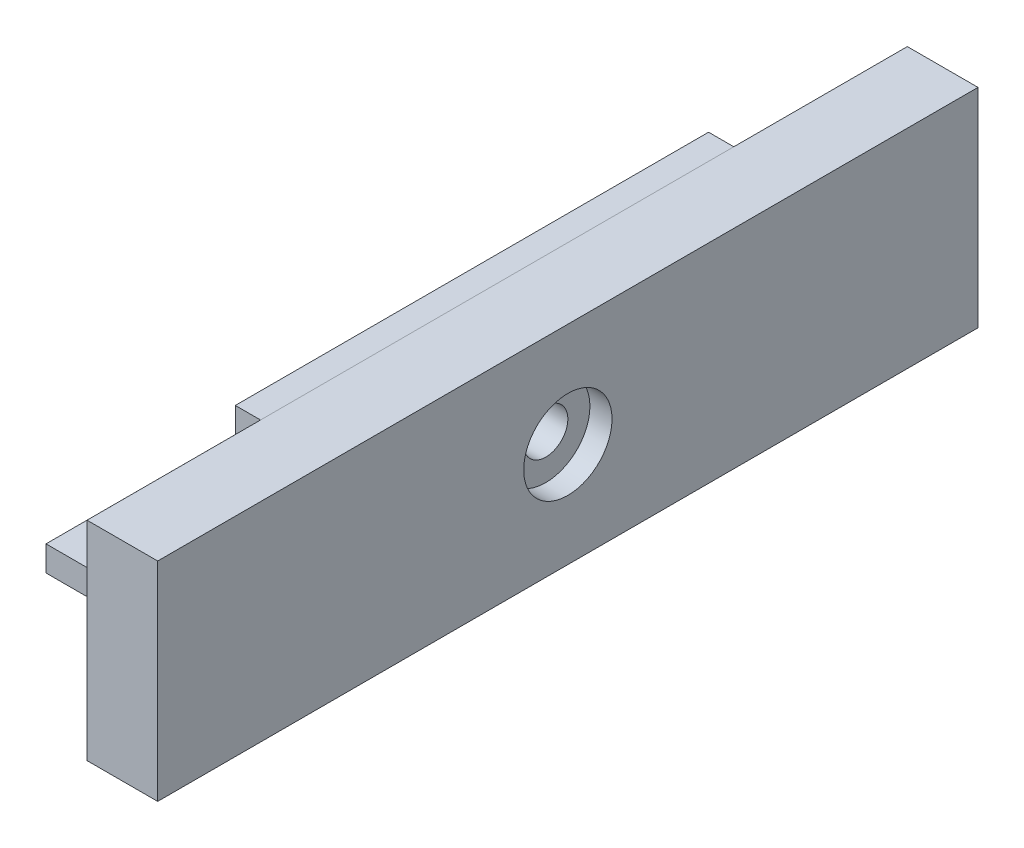
ISO-10303-21;
HEADER;
FILE_DESCRIPTION(('STEP AP214'),'2;1');
FILE_NAME('part.step','',(''),(''),'','','');
FILE_SCHEMA(('AUTOMOTIVE_DESIGN { 1 0 10303 214 1 1 1 1 }'));
ENDSEC;
DATA;
#1=APPLICATION_CONTEXT('core data for automotive mechanical design processes');
#2=APPLICATION_PROTOCOL_DEFINITION('international standard','automotive_design',2000,#1);
#3=PRODUCT_CONTEXT('',#1,'mechanical');
#4=PRODUCT('Part','Part','',(#3));
#5=PRODUCT_RELATED_PRODUCT_CATEGORY('part','',(#4));
#6=PRODUCT_DEFINITION_FORMATION('','',#4);
#7=PRODUCT_DEFINITION_CONTEXT('part definition',#1,'design');
#8=PRODUCT_DEFINITION('design','',#6,#7);
#9=PRODUCT_DEFINITION_SHAPE('','',#8);
#10=(LENGTH_UNIT() NAMED_UNIT(*) SI_UNIT(.MILLI.,.METRE.));
#11=(NAMED_UNIT(*) PLANE_ANGLE_UNIT() SI_UNIT($,.RADIAN.));
#12=(NAMED_UNIT(*) SI_UNIT($,.STERADIAN.) SOLID_ANGLE_UNIT());
#13=UNCERTAINTY_MEASURE_WITH_UNIT(LENGTH_MEASURE(1.E-05),#10,'distance_accuracy_value','');
#14=(GEOMETRIC_REPRESENTATION_CONTEXT(3) GLOBAL_UNCERTAINTY_ASSIGNED_CONTEXT((#13)) GLOBAL_UNIT_ASSIGNED_CONTEXT((#10,
#11,#12)) REPRESENTATION_CONTEXT('',''));
#15=CARTESIAN_POINT('',(0.,0.,0.));
#16=DIRECTION('',(0.,0.,1.));
#17=DIRECTION('',(1.,0.,0.));
#18=AXIS2_PLACEMENT_3D('',#15,#16,#17);
#19=CARTESIAN_POINT('',(-4.,0.,-37.5));
#20=DIRECTION('',(0.,0.,-1.));
#21=DIRECTION('',(-1.,0.,0.));
#22=AXIS2_PLACEMENT_3D('',#19,#20,#21);
#23=PLANE('',#22);
#24=DIRECTION('',(0.,1.,0.));
#25=VECTOR('',#24,1.);
#26=CARTESIAN_POINT('',(0.,0.,-37.5));
#27=LINE('',#26,#25);
#28=CARTESIAN_POINT('',(0.,-21.5,-37.5));
#29=VERTEX_POINT('',#28);
#30=CARTESIAN_POINT('',(0.,16.5,-37.5));
#31=VERTEX_POINT('',#30);
#32=EDGE_CURVE('E95',#29,#31,#27,.T.);
#33=ORIENTED_EDGE('',*,*,#32,.F.);
#34=DIRECTION('',(1.,0.,0.));
#35=VECTOR('',#34,1.);
#36=CARTESIAN_POINT('',(-4.,-21.5,-37.5));
#37=LINE('',#36,#35);
#38=CARTESIAN_POINT('',(-34.,-21.5,-37.5));
#39=VERTEX_POINT('',#38);
#40=EDGE_CURVE('E12',#39,#29,#37,.T.);
#41=ORIENTED_EDGE('',*,*,#40,.F.);
#42=DIRECTION('',(0.,-1.,0.));
#43=VECTOR('',#42,1.);
#44=CARTESIAN_POINT('',(-34.,-21.5,-37.5));
#45=LINE('',#44,#43);
#46=CARTESIAN_POINT('',(-34.,-17.4979666653314,-37.5));
#47=VERTEX_POINT('',#46);
#48=EDGE_CURVE('E144',#47,#39,#45,.T.);
#49=ORIENTED_EDGE('',*,*,#48,.F.);
#50=DIRECTION('',(1.,0.,0.));
#51=VECTOR('',#50,1.);
#52=CARTESIAN_POINT('',(-34.,-17.4979666653314,-37.5));
#53=LINE('',#52,#51);
#54=CARTESIAN_POINT('',(-4.,-17.4979666653314,-37.5));
#55=VERTEX_POINT('',#54);
#56=EDGE_CURVE('E120',#47,#55,#53,.T.);
#57=ORIENTED_EDGE('',*,*,#56,.T.);
#58=DIRECTION('',(0.,1.,0.));
#59=VECTOR('',#58,1.);
#60=CARTESIAN_POINT('',(-4.,0.,-37.5));
#61=LINE('',#60,#59);
#62=CARTESIAN_POINT('',(-4.,16.5,-37.5));
#63=VERTEX_POINT('',#62);
#64=EDGE_CURVE('E75',#55,#63,#61,.T.);
#65=ORIENTED_EDGE('',*,*,#64,.T.);
#66=DIRECTION('',(1.,0.,0.));
#67=VECTOR('',#66,1.);
#68=CARTESIAN_POINT('',(-4.,16.5,-37.5));
#69=LINE('',#68,#67);
#70=EDGE_CURVE('E91',#63,#31,#69,.T.);
#71=ORIENTED_EDGE('',*,*,#70,.T.);
#72=EDGE_LOOP('',(#33,#41,#49,#57,#65,#71));
#73=FACE_BOUND('',#72,.T.);
#74=ADVANCED_FACE('F53',(#73),#23,.T.);
#75=CARTESIAN_POINT('',(-4.,-21.5,0.));
#76=DIRECTION('',(0.,-1.,0.));
#77=DIRECTION('',(0.,0.,-1.));
#78=AXIS2_PLACEMENT_3D('',#75,#76,#77);
#79=PLANE('',#78);
#80=DIRECTION('',(0.,0.,-1.));
#81=VECTOR('',#80,1.);
#82=CARTESIAN_POINT('',(0.,-21.5,0.));
#83=LINE('',#82,#81);
#84=CARTESIAN_POINT('',(0.,-21.5,37.5));
#85=VERTEX_POINT('',#84);
#86=EDGE_CURVE('E115',#85,#29,#83,.T.);
#87=ORIENTED_EDGE('',*,*,#86,.F.);
#88=DIRECTION('',(1.,0.,0.));
#89=VECTOR('',#88,1.);
#90=CARTESIAN_POINT('',(-4.,-21.5,37.5));
#91=LINE('',#90,#89);
#92=CARTESIAN_POINT('',(-34.,-21.5,37.5));
#93=VERTEX_POINT('',#92);
#94=EDGE_CURVE('E60',#93,#85,#91,.T.);
#95=ORIENTED_EDGE('',*,*,#94,.F.);
#96=DIRECTION('',(0.,0.,1.));
#97=VECTOR('',#96,1.);
#98=CARTESIAN_POINT('',(-34.,-21.5,37.5));
#99=LINE('',#98,#97);
#100=EDGE_CURVE('E140',#39,#93,#99,.T.);
#101=ORIENTED_EDGE('',*,*,#100,.F.);
#102=ORIENTED_EDGE('',*,*,#40,.T.);
#103=EDGE_LOOP('',(#87,#95,#101,#102));
#104=FACE_BOUND('',#103,.T.);
#105=ADVANCED_FACE('F138',(#104),#79,.T.);
#106=CARTESIAN_POINT('',(-4.,0.,37.5));
#107=DIRECTION('',(0.,0.,-1.));
#108=DIRECTION('',(-1.,0.,0.));
#109=AXIS2_PLACEMENT_3D('',#106,#107,#108);
#110=PLANE('',#109);
#111=DIRECTION('',(0.,1.,0.));
#112=VECTOR('',#111,1.);
#113=CARTESIAN_POINT('',(0.,0.,37.5));
#114=LINE('',#113,#112);
#115=CARTESIAN_POINT('',(0.,16.5,37.5));
#116=VERTEX_POINT('',#115);
#117=EDGE_CURVE('E110',#85,#116,#114,.T.);
#118=ORIENTED_EDGE('',*,*,#117,.T.);
#119=DIRECTION('',(1.,0.,0.));
#120=VECTOR('',#119,1.);
#121=CARTESIAN_POINT('',(-4.,16.5,37.5));
#122=LINE('',#121,#120);
#123=CARTESIAN_POINT('',(-4.,16.5,37.5));
#124=VERTEX_POINT('',#123);
#125=EDGE_CURVE('E99',#124,#116,#122,.T.);
#126=ORIENTED_EDGE('',*,*,#125,.F.);
#127=DIRECTION('',(0.,1.,0.));
#128=VECTOR('',#127,1.);
#129=CARTESIAN_POINT('',(-4.,0.,37.5));
#130=LINE('',#129,#128);
#131=CARTESIAN_POINT('',(-4.,-17.4979666653314,37.5));
#132=VERTEX_POINT('',#131);
#133=EDGE_CURVE('E160',#132,#124,#130,.T.);
#134=ORIENTED_EDGE('',*,*,#133,.F.);
#135=DIRECTION('',(1.,0.,0.));
#136=VECTOR('',#135,1.);
#137=CARTESIAN_POINT('',(-34.,-17.4979666653314,37.5));
#138=LINE('',#137,#136);
#139=CARTESIAN_POINT('',(-34.,-17.4979666653314,37.5));
#140=VERTEX_POINT('',#139);
#141=EDGE_CURVE('E116',#140,#132,#138,.T.);
#142=ORIENTED_EDGE('',*,*,#141,.F.);
#143=DIRECTION('',(0.,1.,0.));
#144=VECTOR('',#143,1.);
#145=CARTESIAN_POINT('',(-34.,-21.5,37.5));
#146=LINE('',#145,#144);
#147=EDGE_CURVE('E134',#93,#140,#146,.T.);
#148=ORIENTED_EDGE('',*,*,#147,.F.);
#149=ORIENTED_EDGE('',*,*,#94,.T.);
#150=EDGE_LOOP('',(#118,#126,#134,#142,#148,#149));
#151=FACE_BOUND('',#150,.T.);
#152=ADVANCED_FACE('F131',(#151),#110,.F.);
#153=CARTESIAN_POINT('',(-4.,16.5,0.));
#154=DIRECTION('',(0.,-1.,0.));
#155=DIRECTION('',(0.,0.,-1.));
#156=AXIS2_PLACEMENT_3D('',#153,#154,#155);
#157=PLANE('',#156);
#158=DIRECTION('',(0.,0.,-1.));
#159=VECTOR('',#158,1.);
#160=CARTESIAN_POINT('',(0.,16.5,0.));
#161=LINE('',#160,#159);
#162=EDGE_CURVE('E104',#116,#31,#161,.T.);
#163=ORIENTED_EDGE('',*,*,#162,.T.);
#164=ORIENTED_EDGE('',*,*,#70,.F.);
#165=DIRECTION('',(0.,0.,-1.));
#166=VECTOR('',#165,1.);
#167=CARTESIAN_POINT('',(-4.,16.5,0.));
#168=LINE('',#167,#166);
#169=EDGE_CURVE('E161',#124,#63,#168,.T.);
#170=ORIENTED_EDGE('',*,*,#169,.F.);
#171=ORIENTED_EDGE('',*,*,#125,.T.);
#172=EDGE_LOOP('',(#163,#164,#170,#171));
#173=FACE_BOUND('',#172,.T.);
#174=ADVANCED_FACE('F105',(#173),#157,.F.);
#175=CARTESIAN_POINT('',(-4.,0.,0.));
#176=DIRECTION('',(1.,0.,0.));
#177=DIRECTION('',(0.,0.,-1.));
#178=AXIS2_PLACEMENT_3D('',#175,#176,#177);
#179=CYLINDRICAL_SURFACE('',#178,3.5);
#180=CARTESIAN_POINT('',(-4.,0.,0.));
#181=DIRECTION('',(-1.,0.,0.));
#182=DIRECTION('',(0.,0.,1.));
#183=AXIS2_PLACEMENT_3D('',#180,#181,#182);
#184=CIRCLE('',#183,3.5);
#185=CARTESIAN_POINT('',(-4.,0.,3.5));
#186=VERTEX_POINT('',#185);
#187=EDGE_CURVE('E100',#186,#186,#184,.F.);
#188=ORIENTED_EDGE('',*,*,#187,.F.);
#189=EDGE_LOOP('',(#188));
#190=FACE_BOUND('',#189,.T.);
#191=CARTESIAN_POINT('',(0.,0.,0.));
#192=DIRECTION('',(-1.,0.,0.));
#193=DIRECTION('',(0.,0.,1.));
#194=AXIS2_PLACEMENT_3D('',#191,#192,#193);
#195=CIRCLE('',#194,3.5);
#196=CARTESIAN_POINT('',(0.,0.,3.5));
#197=VERTEX_POINT('',#196);
#198=EDGE_CURVE('E109',#197,#197,#195,.F.);
#199=ORIENTED_EDGE('',*,*,#198,.T.);
#200=EDGE_LOOP('',(#199));
#201=FACE_BOUND('',#200,.T.);
#202=ADVANCED_FACE('F167',(#190,#201),#179,.F.);
#203=CARTESIAN_POINT('',(-4.,0.,0.));
#204=DIRECTION('',(-1.,0.,0.));
#205=DIRECTION('',(0.,0.,1.));
#206=AXIS2_PLACEMENT_3D('',#203,#204,#205);
#207=PLANE('',#206);
#208=DIRECTION('',(0.,0.,-1.));
#209=VECTOR('',#208,1.);
#210=CARTESIAN_POINT('',(-4.,-17.4979666653314,37.5));
#211=LINE('',#210,#209);
#212=EDGE_CURVE('E67',#132,#55,#211,.T.);
#213=ORIENTED_EDGE('',*,*,#212,.F.);
#214=ORIENTED_EDGE('',*,*,#133,.T.);
#215=ORIENTED_EDGE('',*,*,#169,.T.);
#216=ORIENTED_EDGE('',*,*,#64,.F.);
#217=EDGE_LOOP('',(#213,#214,#215,#216));
#218=FACE_BOUND('',#217,.T.);
#219=ORIENTED_EDGE('',*,*,#187,.T.);
#220=EDGE_LOOP('',(#219));
#221=FACE_BOUND('',#220,.T.);
#222=ADVANCED_FACE('F165',(#218,#221),#207,.T.);
#223=CARTESIAN_POINT('',(0.,0.,0.));
#224=DIRECTION('',(-1.,0.,0.));
#225=DIRECTION('',(0.,0.,1.));
#226=AXIS2_PLACEMENT_3D('',#223,#224,#225);
#227=PLANE('',#226);
#228=ORIENTED_EDGE('',*,*,#32,.T.);
#229=ORIENTED_EDGE('',*,*,#162,.F.);
#230=ORIENTED_EDGE('',*,*,#117,.F.);
#231=ORIENTED_EDGE('',*,*,#86,.T.);
#232=EDGE_LOOP('',(#228,#229,#230,#231));
#233=FACE_BOUND('',#232,.T.);
#234=ORIENTED_EDGE('',*,*,#198,.F.);
#235=EDGE_LOOP('',(#234));
#236=FACE_BOUND('',#235,.T.);
#237=ADVANCED_FACE('F112',(#233,#236),#227,.F.);
#238=CARTESIAN_POINT('',(-34.,-17.4979666653314,37.5));
#239=DIRECTION('',(0.,-1.,0.));
#240=DIRECTION('',(0.,0.,-1.));
#241=AXIS2_PLACEMENT_3D('',#238,#239,#240);
#242=PLANE('',#241);
#243=ORIENTED_EDGE('',*,*,#212,.T.);
#244=ORIENTED_EDGE('',*,*,#56,.F.);
#245=DIRECTION('',(0.,0.,-1.));
#246=VECTOR('',#245,1.);
#247=CARTESIAN_POINT('',(-34.,-17.4979666653314,37.5));
#248=LINE('',#247,#246);
#249=EDGE_CURVE('E150',#140,#47,#248,.T.);
#250=ORIENTED_EDGE('',*,*,#249,.F.);
#251=ORIENTED_EDGE('',*,*,#141,.T.);
#252=EDGE_LOOP('',(#243,#244,#250,#251));
#253=FACE_BOUND('',#252,.T.);
#254=ADVANCED_FACE('F173',(#253),#242,.F.);
#255=CARTESIAN_POINT('',(-34.,0.,0.));
#256=DIRECTION('',(-1.,0.,0.));
#257=DIRECTION('',(0.,0.,1.));
#258=AXIS2_PLACEMENT_3D('',#255,#256,#257);
#259=PLANE('',#258);
#260=ORIENTED_EDGE('',*,*,#147,.T.);
#261=ORIENTED_EDGE('',*,*,#249,.T.);
#262=ORIENTED_EDGE('',*,*,#48,.T.);
#263=ORIENTED_EDGE('',*,*,#100,.T.);
#264=EDGE_LOOP('',(#260,#261,#262,#263));
#265=FACE_BOUND('',#264,.T.);
#266=ADVANCED_FACE('F148',(#265),#259,.T.);
#267=CLOSED_SHELL('',(#74,#105,#152,#174,#202,#222,#237,#254,#266));
#268=MANIFOLD_SOLID_BREP('B2',#267);
#269=CARTESIAN_POINT('',(0.,0.,0.));
#270=DIRECTION('',(1.,0.,0.));
#271=DIRECTION('',(0.,0.,-1.));
#272=AXIS2_PLACEMENT_3D('',#269,#270,#271);
#273=PLANE('',#272);
#274=DIRECTION('',(0.,1.,0.));
#275=VECTOR('',#274,1.);
#276=CARTESIAN_POINT('',(0.,0.,37.5));
#277=LINE('',#276,#275);
#278=CARTESIAN_POINT('',(0.,-16.5,37.5));
#279=VERTEX_POINT('',#278);
#280=CARTESIAN_POINT('',(0.,16.5,37.5));
#281=VERTEX_POINT('',#280);
#282=EDGE_CURVE('E384',#279,#281,#277,.T.);
#283=ORIENTED_EDGE('',*,*,#282,.F.);
#284=DIRECTION('',(0.,0.,-1.));
#285=VECTOR('',#284,1.);
#286=CARTESIAN_POINT('',(0.,-16.5,65.));
#287=LINE('',#286,#285);
#288=CARTESIAN_POINT('',(0.,-16.5,65.));
#289=VERTEX_POINT('',#288);
#290=EDGE_CURVE('E421',#289,#279,#287,.T.);
#291=ORIENTED_EDGE('',*,*,#290,.F.);
#292=DIRECTION('',(0.,-1.,0.));
#293=VECTOR('',#292,1.);
#294=CARTESIAN_POINT('',(0.,16.5,65.));
#295=LINE('',#294,#293);
#296=CARTESIAN_POINT('',(0.,16.5,65.));
#297=VERTEX_POINT('',#296);
#298=EDGE_CURVE('E439',#297,#289,#295,.T.);
#299=ORIENTED_EDGE('',*,*,#298,.F.);
#300=DIRECTION('',(0.,0.,1.));
#301=VECTOR('',#300,1.);
#302=CARTESIAN_POINT('',(0.,16.5,65.));
#303=LINE('',#302,#301);
#304=EDGE_CURVE('E435',#281,#297,#303,.T.);
#305=ORIENTED_EDGE('',*,*,#304,.F.);
#306=EDGE_LOOP('',(#283,#291,#299,#305));
#307=FACE_BOUND('',#306,.T.);
#308=ADVANCED_FACE('F292',(#307),#273,.F.);
#309=CARTESIAN_POINT('',(11.2,0.,0.));
#310=DIRECTION('',(-1.,0.,0.));
#311=DIRECTION('',(0.,0.,1.));
#312=AXIS2_PLACEMENT_3D('',#309,#310,#311);
#313=CYLINDRICAL_SURFACE('',#312,3.5);
#314=CARTESIAN_POINT('',(7.7,0.,0.));
#315=DIRECTION('',(1.,0.,0.));
#316=DIRECTION('',(0.,0.,-1.));
#317=AXIS2_PLACEMENT_3D('',#314,#315,#316);
#318=CIRCLE('',#317,3.5);
#319=CARTESIAN_POINT('',(7.7,0.,-3.5));
#320=VERTEX_POINT('',#319);
#321=EDGE_CURVE('E296',#320,#320,#318,.T.);
#322=ORIENTED_EDGE('',*,*,#321,.T.);
#323=EDGE_LOOP('',(#322));
#324=FACE_BOUND('',#323,.T.);
#325=CARTESIAN_POINT('',(-4.,0.,0.));
#326=DIRECTION('',(-1.,0.,0.));
#327=DIRECTION('',(0.,0.,1.));
#328=AXIS2_PLACEMENT_3D('',#325,#326,#327);
#329=CIRCLE('',#328,3.5);
#330=CARTESIAN_POINT('',(-4.,0.,3.5));
#331=VERTEX_POINT('',#330);
#332=EDGE_CURVE('E394',#331,#331,#329,.F.);
#333=ORIENTED_EDGE('',*,*,#332,.F.);
#334=EDGE_LOOP('',(#333));
#335=FACE_BOUND('',#334,.T.);
#336=ADVANCED_FACE('F478',(#324,#335),#313,.F.);
#337=CARTESIAN_POINT('',(11.2,0.,0.));
#338=DIRECTION('',(1.,0.,0.));
#339=DIRECTION('',(0.,0.,-1.));
#340=AXIS2_PLACEMENT_3D('',#337,#338,#339);
#341=PLANE('',#340);
#342=CARTESIAN_POINT('',(11.2,0.,0.));
#343=DIRECTION('',(1.,0.,0.));
#344=DIRECTION('',(0.,0.,-1.));
#345=AXIS2_PLACEMENT_3D('',#342,#343,#344);
#346=CIRCLE('',#345,7.);
#347=CARTESIAN_POINT('',(11.2,0.,-7.));
#348=VERTEX_POINT('',#347);
#349=EDGE_CURVE('E365',#348,#348,#346,.T.);
#350=ORIENTED_EDGE('',*,*,#349,.F.);
#351=EDGE_LOOP('',(#350));
#352=FACE_BOUND('',#351,.T.);
#353=DIRECTION('',(0.,1.,0.));
#354=VECTOR('',#353,1.);
#355=CARTESIAN_POINT('',(11.2,16.5,-65.));
#356=LINE('',#355,#354);
#357=CARTESIAN_POINT('',(11.2,-16.5,-65.));
#358=VERTEX_POINT('',#357);
#359=CARTESIAN_POINT('',(11.2,16.5,-65.));
#360=VERTEX_POINT('',#359);
#361=EDGE_CURVE('E416',#358,#360,#356,.T.);
#362=ORIENTED_EDGE('',*,*,#361,.T.);
#363=DIRECTION('',(0.,0.,1.));
#364=VECTOR('',#363,1.);
#365=CARTESIAN_POINT('',(11.2,16.5,65.));
#366=LINE('',#365,#364);
#367=CARTESIAN_POINT('',(11.2,16.5,65.));
#368=VERTEX_POINT('',#367);
#369=EDGE_CURVE('E420',#360,#368,#366,.T.);
#370=ORIENTED_EDGE('',*,*,#369,.T.);
#371=DIRECTION('',(0.,-1.,0.));
#372=VECTOR('',#371,1.);
#373=CARTESIAN_POINT('',(11.2,16.5,65.));
#374=LINE('',#373,#372);
#375=CARTESIAN_POINT('',(11.2,-16.5,65.));
#376=VERTEX_POINT('',#375);
#377=EDGE_CURVE('E424',#368,#376,#374,.T.);
#378=ORIENTED_EDGE('',*,*,#377,.T.);
#379=DIRECTION('',(0.,0.,-1.));
#380=VECTOR('',#379,1.);
#381=CARTESIAN_POINT('',(11.2,-16.5,65.));
#382=LINE('',#381,#380);
#383=EDGE_CURVE('E427',#376,#358,#382,.T.);
#384=ORIENTED_EDGE('',*,*,#383,.T.);
#385=EDGE_LOOP('',(#362,#370,#378,#384));
#386=FACE_BOUND('',#385,.T.);
#387=ADVANCED_FACE('F493',(#352,#386),#341,.T.);
#388=CARTESIAN_POINT('',(0.,-16.5,-37.5));
#389=VERTEX_POINT('',#388);
#390=CARTESIAN_POINT('',(0.,-16.5,-65.));
#391=VERTEX_POINT('',#390);
#392=EDGE_CURVE('E314',#389,#391,#287,.T.);
#393=ORIENTED_EDGE('',*,*,#392,.F.);
#394=DIRECTION('',(0.,1.,0.));
#395=VECTOR('',#394,1.);
#396=CARTESIAN_POINT('',(0.,0.,-37.5));
#397=LINE('',#396,#395);
#398=CARTESIAN_POINT('',(0.,16.5,-37.5));
#399=VERTEX_POINT('',#398);
#400=EDGE_CURVE('E309',#389,#399,#397,.T.);
#401=ORIENTED_EDGE('',*,*,#400,.T.);
#402=CARTESIAN_POINT('',(0.,16.5,-65.));
#403=VERTEX_POINT('',#402);
#404=EDGE_CURVE('E436',#403,#399,#303,.T.);
#405=ORIENTED_EDGE('',*,*,#404,.F.);
#406=DIRECTION('',(0.,1.,0.));
#407=VECTOR('',#406,1.);
#408=CARTESIAN_POINT('',(0.,16.5,-65.));
#409=LINE('',#408,#407);
#410=EDGE_CURVE('E431',#391,#403,#409,.T.);
#411=ORIENTED_EDGE('',*,*,#410,.F.);
#412=EDGE_LOOP('',(#393,#401,#405,#411));
#413=FACE_BOUND('',#412,.T.);
#414=ADVANCED_FACE('F468',(#413),#273,.F.);
#415=CARTESIAN_POINT('',(11.2,16.5,-65.));
#416=DIRECTION('',(0.,0.,1.));
#417=DIRECTION('',(1.,0.,0.));
#418=AXIS2_PLACEMENT_3D('',#415,#416,#417);
#419=PLANE('',#418);
#420=ORIENTED_EDGE('',*,*,#410,.T.);
#421=DIRECTION('',(-1.,0.,0.));
#422=VECTOR('',#421,1.);
#423=CARTESIAN_POINT('',(11.2,16.5,-65.));
#424=LINE('',#423,#422);
#425=EDGE_CURVE('E51',#360,#403,#424,.T.);
#426=ORIENTED_EDGE('',*,*,#425,.F.);
#427=ORIENTED_EDGE('',*,*,#361,.F.);
#428=DIRECTION('',(-1.,0.,0.));
#429=VECTOR('',#428,1.);
#430=CARTESIAN_POINT('',(11.2,-16.5,-65.));
#431=LINE('',#430,#429);
#432=EDGE_CURVE('E430',#358,#391,#431,.T.);
#433=ORIENTED_EDGE('',*,*,#432,.T.);
#434=EDGE_LOOP('',(#420,#426,#427,#433));
#435=FACE_BOUND('',#434,.T.);
#436=ADVANCED_FACE('F294',(#435),#419,.F.);
#437=CARTESIAN_POINT('',(11.2,16.5,65.));
#438=DIRECTION('',(0.,-1.,0.));
#439=DIRECTION('',(0.,0.,-1.));
#440=AXIS2_PLACEMENT_3D('',#437,#438,#439);
#441=PLANE('',#440);
#442=ORIENTED_EDGE('',*,*,#404,.T.);
#443=DIRECTION('',(1.,0.,0.));
#444=VECTOR('',#443,1.);
#445=CARTESIAN_POINT('',(-4.,16.5,-37.5));
#446=LINE('',#445,#444);
#447=CARTESIAN_POINT('',(-4.,16.5,-37.5));
#448=VERTEX_POINT('',#447);
#449=EDGE_CURVE('E398',#448,#399,#446,.T.);
#450=ORIENTED_EDGE('',*,*,#449,.F.);
#451=DIRECTION('',(0.,0.,-1.));
#452=VECTOR('',#451,1.);
#453=CARTESIAN_POINT('',(-4.,16.5,0.));
#454=LINE('',#453,#452);
#455=CARTESIAN_POINT('',(-4.,16.5,37.5));
#456=VERTEX_POINT('',#455);
#457=EDGE_CURVE('E381',#456,#448,#454,.T.);
#458=ORIENTED_EDGE('',*,*,#457,.F.);
#459=DIRECTION('',(1.,0.,0.));
#460=VECTOR('',#459,1.);
#461=CARTESIAN_POINT('',(-4.,16.5,37.5));
#462=LINE('',#461,#460);
#463=EDGE_CURVE('E403',#456,#281,#462,.T.);
#464=ORIENTED_EDGE('',*,*,#463,.T.);
#465=ORIENTED_EDGE('',*,*,#304,.T.);
#466=DIRECTION('',(-1.,0.,0.));
#467=VECTOR('',#466,1.);
#468=CARTESIAN_POINT('',(11.2,16.5,65.));
#469=LINE('',#468,#467);
#470=EDGE_CURVE('E302',#368,#297,#469,.T.);
#471=ORIENTED_EDGE('',*,*,#470,.F.);
#472=ORIENTED_EDGE('',*,*,#369,.F.);
#473=ORIENTED_EDGE('',*,*,#425,.T.);
#474=EDGE_LOOP('',(#442,#450,#458,#464,#465,#471,#472,#473));
#475=FACE_BOUND('',#474,.T.);
#476=ADVANCED_FACE('F466',(#475),#441,.F.);
#477=CARTESIAN_POINT('',(11.2,16.5,65.));
#478=DIRECTION('',(0.,0.,-1.));
#479=DIRECTION('',(-1.,0.,0.));
#480=AXIS2_PLACEMENT_3D('',#477,#478,#479);
#481=PLANE('',#480);
#482=ORIENTED_EDGE('',*,*,#298,.T.);
#483=DIRECTION('',(-1.,0.,0.));
#484=VECTOR('',#483,1.);
#485=CARTESIAN_POINT('',(11.2,-16.5,65.));
#486=LINE('',#485,#484);
#487=EDGE_CURVE('E447',#376,#289,#486,.T.);
#488=ORIENTED_EDGE('',*,*,#487,.F.);
#489=ORIENTED_EDGE('',*,*,#377,.F.);
#490=ORIENTED_EDGE('',*,*,#470,.T.);
#491=EDGE_LOOP('',(#482,#488,#489,#490));
#492=FACE_BOUND('',#491,.T.);
#493=ADVANCED_FACE('F457',(#492),#481,.F.);
#494=CARTESIAN_POINT('',(11.2,-16.5,65.));
#495=DIRECTION('',(0.,1.,0.));
#496=DIRECTION('',(0.,0.,1.));
#497=AXIS2_PLACEMENT_3D('',#494,#495,#496);
#498=PLANE('',#497);
#499=ORIENTED_EDGE('',*,*,#290,.T.);
#500=DIRECTION('',(1.,0.,0.));
#501=VECTOR('',#500,1.);
#502=CARTESIAN_POINT('',(-4.,-16.5,37.5));
#503=LINE('',#502,#501);
#504=CARTESIAN_POINT('',(-4.,-16.5,37.5));
#505=VERTEX_POINT('',#504);
#506=EDGE_CURVE('E366',#505,#279,#503,.T.);
#507=ORIENTED_EDGE('',*,*,#506,.F.);
#508=DIRECTION('',(0.,0.,1.));
#509=VECTOR('',#508,1.);
#510=CARTESIAN_POINT('',(-4.,-16.5,0.));
#511=LINE('',#510,#509);
#512=CARTESIAN_POINT('',(-4.,-16.5,-37.5));
#513=VERTEX_POINT('',#512);
#514=EDGE_CURVE('E369',#513,#505,#511,.T.);
#515=ORIENTED_EDGE('',*,*,#514,.F.);
#516=DIRECTION('',(1.,0.,0.));
#517=VECTOR('',#516,1.);
#518=CARTESIAN_POINT('',(-4.,-16.5,-37.5));
#519=LINE('',#518,#517);
#520=EDGE_CURVE('E357',#513,#389,#519,.T.);
#521=ORIENTED_EDGE('',*,*,#520,.T.);
#522=ORIENTED_EDGE('',*,*,#392,.T.);
#523=ORIENTED_EDGE('',*,*,#432,.F.);
#524=ORIENTED_EDGE('',*,*,#383,.F.);
#525=ORIENTED_EDGE('',*,*,#487,.T.);
#526=EDGE_LOOP('',(#499,#507,#515,#521,#522,#523,#524,#525));
#527=FACE_BOUND('',#526,.T.);
#528=ADVANCED_FACE('F371',(#527),#498,.F.);
#529=CARTESIAN_POINT('',(7.7,0.,0.));
#530=DIRECTION('',(1.,0.,0.));
#531=DIRECTION('',(0.,0.,-1.));
#532=AXIS2_PLACEMENT_3D('',#529,#530,#531);
#533=CYLINDRICAL_SURFACE('',#532,7.);
#534=CARTESIAN_POINT('',(7.7,0.,0.));
#535=DIRECTION('',(1.,0.,0.));
#536=DIRECTION('',(0.,0.,-1.));
#537=AXIS2_PLACEMENT_3D('',#534,#535,#536);
#538=CIRCLE('',#537,7.);
#539=CARTESIAN_POINT('',(7.7,0.,-7.));
#540=VERTEX_POINT('',#539);
#541=EDGE_CURVE('E409',#540,#540,#538,.T.);
#542=ORIENTED_EDGE('',*,*,#541,.F.);
#543=EDGE_LOOP('',(#542));
#544=FACE_BOUND('',#543,.T.);
#545=ORIENTED_EDGE('',*,*,#349,.T.);
#546=EDGE_LOOP('',(#545));
#547=FACE_BOUND('',#546,.T.);
#548=ADVANCED_FACE('F484',(#544,#547),#533,.F.);
#549=CARTESIAN_POINT('',(7.7,0.,0.));
#550=DIRECTION('',(1.,0.,0.));
#551=DIRECTION('',(0.,0.,-1.));
#552=AXIS2_PLACEMENT_3D('',#549,#550,#551);
#553=PLANE('',#552);
#554=ORIENTED_EDGE('',*,*,#321,.F.);
#555=EDGE_LOOP('',(#554));
#556=FACE_BOUND('',#555,.T.);
#557=ORIENTED_EDGE('',*,*,#541,.T.);
#558=EDGE_LOOP('',(#557));
#559=FACE_BOUND('',#558,.T.);
#560=ADVANCED_FACE('F481',(#556,#559),#553,.T.);
#561=CARTESIAN_POINT('',(-4.,0.,-37.5));
#562=DIRECTION('',(0.,0.,-1.));
#563=DIRECTION('',(-1.,0.,0.));
#564=AXIS2_PLACEMENT_3D('',#561,#562,#563);
#565=PLANE('',#564);
#566=ORIENTED_EDGE('',*,*,#400,.F.);
#567=ORIENTED_EDGE('',*,*,#520,.F.);
#568=DIRECTION('',(0.,1.,0.));
#569=VECTOR('',#568,1.);
#570=CARTESIAN_POINT('',(-4.,0.,-37.5));
#571=LINE('',#570,#569);
#572=EDGE_CURVE('E362',#513,#448,#571,.T.);
#573=ORIENTED_EDGE('',*,*,#572,.T.);
#574=ORIENTED_EDGE('',*,*,#449,.T.);
#575=EDGE_LOOP('',(#566,#567,#573,#574));
#576=FACE_BOUND('',#575,.T.);
#577=ADVANCED_FACE('F359',(#576),#565,.T.);
#578=CARTESIAN_POINT('',(-4.,0.,37.5));
#579=DIRECTION('',(0.,0.,-1.));
#580=DIRECTION('',(-1.,0.,0.));
#581=AXIS2_PLACEMENT_3D('',#578,#579,#580);
#582=PLANE('',#581);
#583=ORIENTED_EDGE('',*,*,#282,.T.);
#584=ORIENTED_EDGE('',*,*,#463,.F.);
#585=DIRECTION('',(0.,1.,0.));
#586=VECTOR('',#585,1.);
#587=CARTESIAN_POINT('',(-4.,0.,37.5));
#588=LINE('',#587,#586);
#589=EDGE_CURVE('E376',#505,#456,#588,.T.);
#590=ORIENTED_EDGE('',*,*,#589,.F.);
#591=ORIENTED_EDGE('',*,*,#506,.T.);
#592=EDGE_LOOP('',(#583,#584,#590,#591));
#593=FACE_BOUND('',#592,.T.);
#594=ADVANCED_FACE('F464',(#593),#582,.F.);
#595=CARTESIAN_POINT('',(-4.,0.,0.));
#596=DIRECTION('',(-1.,0.,0.));
#597=DIRECTION('',(0.,0.,1.));
#598=AXIS2_PLACEMENT_3D('',#595,#596,#597);
#599=PLANE('',#598);
#600=ORIENTED_EDGE('',*,*,#572,.F.);
#601=ORIENTED_EDGE('',*,*,#514,.T.);
#602=ORIENTED_EDGE('',*,*,#589,.T.);
#603=ORIENTED_EDGE('',*,*,#457,.T.);
#604=EDGE_LOOP('',(#600,#601,#602,#603));
#605=FACE_BOUND('',#604,.T.);
#606=ORIENTED_EDGE('',*,*,#332,.T.);
#607=EDGE_LOOP('',(#606));
#608=FACE_BOUND('',#607,.T.);
#609=ADVANCED_FACE('F378',(#605,#608),#599,.T.);
#610=CLOSED_SHELL('',(#308,#336,#387,#414,#436,#476,#493,#528,#548,#560,#577,#594,#609));
#611=MANIFOLD_SOLID_BREP('B6',#610);
#612=ADVANCED_BREP_SHAPE_REPRESENTATION('',(#18,#268,#611),#14);
#613=SHAPE_DEFINITION_REPRESENTATION(#9,#612);
ENDSEC;
END-ISO-10303-21;
